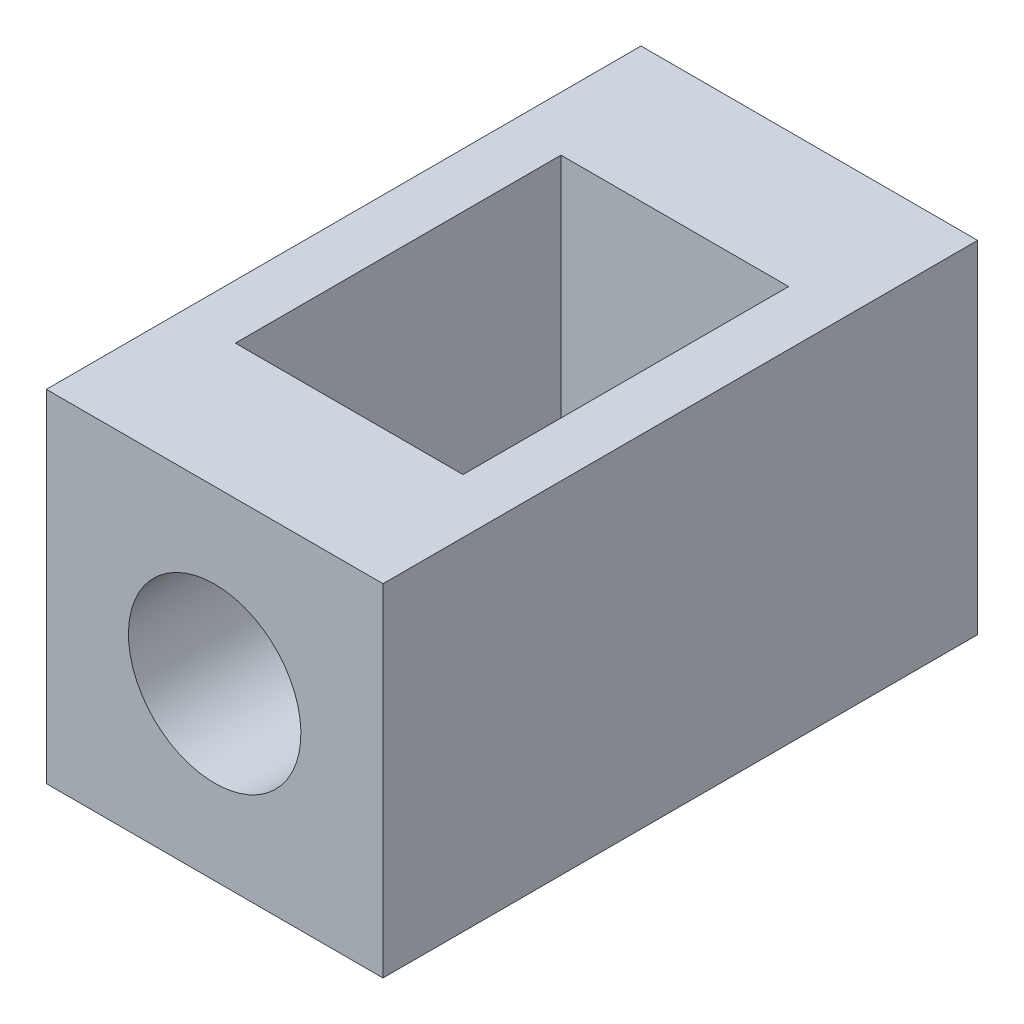
ISO-10303-21;
HEADER;
FILE_DESCRIPTION(('STEP AP214'),'2;1');
FILE_NAME('part.step','',(''),(''),'','','');
FILE_SCHEMA(('AUTOMOTIVE_DESIGN { 1 0 10303 214 1 1 1 1 }'));
ENDSEC;
DATA;
#1=APPLICATION_CONTEXT('core data for automotive mechanical design processes');
#2=APPLICATION_PROTOCOL_DEFINITION('international standard','automotive_design',2000,#1);
#3=PRODUCT_CONTEXT('',#1,'mechanical');
#4=PRODUCT('Part','Part','',(#3));
#5=PRODUCT_RELATED_PRODUCT_CATEGORY('part','',(#4));
#6=PRODUCT_DEFINITION_FORMATION('','',#4);
#7=PRODUCT_DEFINITION_CONTEXT('part definition',#1,'design');
#8=PRODUCT_DEFINITION('design','',#6,#7);
#9=PRODUCT_DEFINITION_SHAPE('','',#8);
#10=(LENGTH_UNIT() NAMED_UNIT(*) SI_UNIT(.MILLI.,.METRE.));
#11=(NAMED_UNIT(*) PLANE_ANGLE_UNIT() SI_UNIT($,.RADIAN.));
#12=(NAMED_UNIT(*) SI_UNIT($,.STERADIAN.) SOLID_ANGLE_UNIT());
#13=UNCERTAINTY_MEASURE_WITH_UNIT(LENGTH_MEASURE(1.E-05),#10,'distance_accuracy_value','');
#14=(GEOMETRIC_REPRESENTATION_CONTEXT(3) GLOBAL_UNCERTAINTY_ASSIGNED_CONTEXT((#13)) GLOBAL_UNIT_ASSIGNED_CONTEXT((#10,
#11,#12)) REPRESENTATION_CONTEXT('',''));
#15=CARTESIAN_POINT('',(0.,0.,0.));
#16=DIRECTION('',(0.,0.,1.));
#17=DIRECTION('',(1.,0.,0.));
#18=AXIS2_PLACEMENT_3D('',#15,#16,#17);
#19=CARTESIAN_POINT('',(-22.8478019032069,-23.3190294111925,14.495));
#20=DIRECTION('',(0.,0.,1.));
#21=DIRECTION('',(3.01991605000675E-07,0.999999999999954,0.));
#22=AXIS2_PLACEMENT_3D('',#19,#20,#21);
#23=CYLINDRICAL_SURFACE('',#22,1.25);
#24=CARTESIAN_POINT('',(-22.8478019032069,-23.3190294111928,12.545));
#25=DIRECTION('',(0.,0.,1.));
#26=DIRECTION('',(3.01991605000675E-07,0.999999999999954,0.));
#27=AXIS2_PLACEMENT_3D('',#24,#25,#26);
#28=CIRCLE('',#27,1.25);
#29=CARTESIAN_POINT('',(-22.8478015257173,-22.0690294111928,12.545));
#30=VERTEX_POINT('',#29);
#31=EDGE_CURVE('E20',#30,#30,#28,.T.);
#32=ORIENTED_EDGE('',*,*,#31,.F.);
#33=EDGE_LOOP('',(#32));
#34=FACE_BOUND('',#33,.T.);
#35=CARTESIAN_POINT('',(-22.8478019032069,-23.3190294111925,14.495));
#36=DIRECTION('',(0.,0.,1.));
#37=DIRECTION('',(3.01991605000675E-07,0.999999999999954,0.));
#38=AXIS2_PLACEMENT_3D('',#35,#36,#37);
#39=CIRCLE('',#38,1.25);
#40=CARTESIAN_POINT('',(-22.8478015257173,-22.0690294111926,14.495));
#41=VERTEX_POINT('',#40);
#42=EDGE_CURVE('E11',#41,#41,#39,.T.);
#43=ORIENTED_EDGE('',*,*,#42,.T.);
#44=EDGE_LOOP('',(#43));
#45=FACE_BOUND('',#44,.T.);
#46=ADVANCED_FACE('F17',(#34,#45),#23,.F.);
#47=CARTESIAN_POINT('',(-20.4078026506358,-25.7940301480523,14.495));
#48=DIRECTION('',(-0.999999999999954,3.01991605000676E-07,0.));
#49=DIRECTION('',(3.01991605000675E-07,0.999999999999954,0.));
#50=AXIS2_PLACEMENT_3D('',#47,#48,#49);
#51=PLANE('',#50);
#52=DIRECTION('',(0.,0.,1.));
#53=VECTOR('',#52,1.);
#54=CARTESIAN_POINT('',(-20.4078011557778,-20.8440301480525,14.495));
#55=LINE('',#54,#53);
#56=CARTESIAN_POINT('',(-20.4078011557778,-20.8440301480528,5.875));
#57=VERTEX_POINT('',#56);
#58=CARTESIAN_POINT('',(-20.4078011557778,-20.8440301480525,14.495));
#59=VERTEX_POINT('',#58);
#60=EDGE_CURVE('E171',#57,#59,#55,.T.);
#61=ORIENTED_EDGE('',*,*,#60,.T.);
#62=DIRECTION('',(3.01991605000675E-07,0.999999999999954,0.));
#63=VECTOR('',#62,1.);
#64=CARTESIAN_POINT('',(-20.4078026506358,-25.7940301480523,14.495));
#65=LINE('',#64,#63);
#66=CARTESIAN_POINT('',(-20.4078026506358,-25.7940301480523,14.495));
#67=VERTEX_POINT('',#66);
#68=EDGE_CURVE('E27',#67,#59,#65,.T.);
#69=ORIENTED_EDGE('',*,*,#68,.F.);
#70=DIRECTION('',(0.,0.,1.));
#71=VECTOR('',#70,1.);
#72=CARTESIAN_POINT('',(-20.4078026506358,-25.7940301480523,14.495));
#73=LINE('',#72,#71);
#74=CARTESIAN_POINT('',(-20.4078026506358,-25.7940301480522,5.875));
#75=VERTEX_POINT('',#74);
#76=EDGE_CURVE('E224',#75,#67,#73,.T.);
#77=ORIENTED_EDGE('',*,*,#76,.F.);
#78=DIRECTION('',(3.01991605000675E-07,0.999999999999954,0.));
#79=VECTOR('',#78,1.);
#80=CARTESIAN_POINT('',(-20.4078026506358,-25.7940301480522,5.875));
#81=LINE('',#80,#79);
#82=EDGE_CURVE('E73',#75,#57,#81,.T.);
#83=ORIENTED_EDGE('',*,*,#82,.T.);
#84=EDGE_LOOP('',(#61,#69,#77,#83));
#85=FACE_BOUND('',#84,.T.);
#86=ADVANCED_FACE('F282',(#85),#51,.F.);
#87=CARTESIAN_POINT('',(-25.2878026506358,-25.7940286743332,14.495));
#88=DIRECTION('',(0.,0.,-1.));
#89=DIRECTION('',(0.999999999999954,-3.01991605000676E-07,0.));
#90=AXIS2_PLACEMENT_3D('',#87,#88,#89);
#91=PLANE('',#90);
#92=ORIENTED_EDGE('',*,*,#42,.F.);
#93=EDGE_LOOP('',(#92));
#94=FACE_BOUND('',#93,.T.);
#95=DIRECTION('',(-0.999999999999954,3.01991605000676E-07,0.));
#96=VECTOR('',#95,1.);
#97=CARTESIAN_POINT('',(-25.2878011557778,-20.8440286743335,14.495));
#98=LINE('',#97,#96);
#99=CARTESIAN_POINT('',(-25.2878011557778,-20.8440286743335,14.495));
#100=VERTEX_POINT('',#99);
#101=EDGE_CURVE('E208',#59,#100,#98,.T.);
#102=ORIENTED_EDGE('',*,*,#101,.T.);
#103=DIRECTION('',(3.01991605000675E-07,0.999999999999954,0.));
#104=VECTOR('',#103,1.);
#105=CARTESIAN_POINT('',(-25.2878026506358,-25.7940286743332,14.495));
#106=LINE('',#105,#104);
#107=CARTESIAN_POINT('',(-25.2878026506358,-25.7940286743332,14.495));
#108=VERTEX_POINT('',#107);
#109=EDGE_CURVE('E213',#108,#100,#106,.T.);
#110=ORIENTED_EDGE('',*,*,#109,.F.);
#111=DIRECTION('',(-0.999999999999954,3.01991605000676E-07,0.));
#112=VECTOR('',#111,1.);
#113=CARTESIAN_POINT('',(-25.2878026506358,-25.7940286743332,14.495));
#114=LINE('',#113,#112);
#115=EDGE_CURVE('E219',#67,#108,#114,.T.);
#116=ORIENTED_EDGE('',*,*,#115,.F.);
#117=ORIENTED_EDGE('',*,*,#68,.T.);
#118=EDGE_LOOP('',(#102,#110,#116,#117));
#119=FACE_BOUND('',#118,.T.);
#120=ADVANCED_FACE('F285',(#94,#119),#91,.F.);
#121=CARTESIAN_POINT('',(-25.2878026506358,-25.7940286743332,14.495));
#122=DIRECTION('',(0.999999999999954,-3.01991605000676E-07,0.));
#123=DIRECTION('',(-3.01991605000675E-07,-0.999999999999954,0.));
#124=AXIS2_PLACEMENT_3D('',#121,#122,#123);
#125=PLANE('',#124);
#126=DIRECTION('',(0.,0.,-1.));
#127=VECTOR('',#126,1.);
#128=CARTESIAN_POINT('',(-25.2878011557778,-20.8440286743335,14.495));
#129=LINE('',#128,#127);
#130=CARTESIAN_POINT('',(-25.2878011557778,-20.8440286743338,5.875));
#131=VERTEX_POINT('',#130);
#132=EDGE_CURVE('E196',#100,#131,#129,.T.);
#133=ORIENTED_EDGE('',*,*,#132,.T.);
#134=DIRECTION('',(3.01991605000675E-07,0.999999999999954,0.));
#135=VECTOR('',#134,1.);
#136=CARTESIAN_POINT('',(-25.2878026506358,-25.7940286743332,5.875));
#137=LINE('',#136,#135);
#138=CARTESIAN_POINT('',(-25.2878026506358,-25.7940286743332,5.875));
#139=VERTEX_POINT('',#138);
#140=EDGE_CURVE('E39',#139,#131,#137,.T.);
#141=ORIENTED_EDGE('',*,*,#140,.F.);
#142=DIRECTION('',(0.,0.,-1.));
#143=VECTOR('',#142,1.);
#144=CARTESIAN_POINT('',(-25.2878026506358,-25.7940286743332,14.495));
#145=LINE('',#144,#143);
#146=EDGE_CURVE('E203',#108,#139,#145,.T.);
#147=ORIENTED_EDGE('',*,*,#146,.F.);
#148=ORIENTED_EDGE('',*,*,#109,.T.);
#149=EDGE_LOOP('',(#133,#141,#147,#148));
#150=FACE_BOUND('',#149,.T.);
#151=ADVANCED_FACE('F287',(#150),#125,.F.);
#152=CARTESIAN_POINT('',(-25.2878026506358,-25.7940286743332,5.875));
#153=DIRECTION('',(0.,0.,1.));
#154=DIRECTION('',(-0.999999999999954,3.01991605000676E-07,0.));
#155=AXIS2_PLACEMENT_3D('',#152,#153,#154);
#156=PLANE('',#155);
#157=DIRECTION('',(0.999999999999954,-3.01991605000676E-07,0.));
#158=VECTOR('',#157,1.);
#159=CARTESIAN_POINT('',(-25.2878011557778,-20.8440286743338,5.875));
#160=LINE('',#159,#158);
#161=EDGE_CURVE('E193',#131,#57,#160,.T.);
#162=ORIENTED_EDGE('',*,*,#161,.T.);
#163=ORIENTED_EDGE('',*,*,#82,.F.);
#164=DIRECTION('',(0.999999999999954,-3.01991605000676E-07,0.));
#165=VECTOR('',#164,1.);
#166=CARTESIAN_POINT('',(-25.2878026506358,-25.7940286743332,5.875));
#167=LINE('',#166,#165);
#168=EDGE_CURVE('E199',#139,#75,#167,.T.);
#169=ORIENTED_EDGE('',*,*,#168,.F.);
#170=ORIENTED_EDGE('',*,*,#140,.T.);
#171=EDGE_LOOP('',(#162,#163,#169,#170));
#172=FACE_BOUND('',#171,.T.);
#173=ADVANCED_FACE('F303',(#172),#156,.F.);
#174=CARTESIAN_POINT('',(-22.8478026506358,-25.7940294111928,10.185));
#175=DIRECTION('',(-3.01991605000675E-07,-0.999999999999954,0.));
#176=DIRECTION('',(-0.999999999999954,3.01991605000676E-07,0.));
#177=AXIS2_PLACEMENT_3D('',#174,#175,#176);
#178=PLANE('',#177);
#179=DIRECTION('',(0.,0.,1.));
#180=VECTOR('',#179,1.);
#181=CARTESIAN_POINT('',(-21.1978026506358,-25.7940299094789,10.185));
#182=LINE('',#181,#180);
#183=CARTESIAN_POINT('',(-21.1978026506358,-25.7940299094789,7.825));
#184=VERTEX_POINT('',#183);
#185=CARTESIAN_POINT('',(-21.1978026506358,-25.7940299094789,12.545));
#186=VERTEX_POINT('',#185);
#187=EDGE_CURVE('E166',#184,#186,#182,.T.);
#188=ORIENTED_EDGE('',*,*,#187,.F.);
#189=DIRECTION('',(0.999999999999954,-3.01991605000676E-07,0.));
#190=VECTOR('',#189,1.);
#191=CARTESIAN_POINT('',(-22.8478026506358,-25.7940294111928,7.825));
#192=LINE('',#191,#190);
#193=CARTESIAN_POINT('',(-24.4978026506358,-25.7940289129066,7.825));
#194=VERTEX_POINT('',#193);
#195=EDGE_CURVE('E127',#194,#184,#192,.T.);
#196=ORIENTED_EDGE('',*,*,#195,.F.);
#197=DIRECTION('',(0.,0.,-1.));
#198=VECTOR('',#197,1.);
#199=CARTESIAN_POINT('',(-24.4978026506358,-25.7940289129066,10.185));
#200=LINE('',#199,#198);
#201=CARTESIAN_POINT('',(-24.4978026506358,-25.7940289129066,12.545));
#202=VERTEX_POINT('',#201);
#203=EDGE_CURVE('E151',#202,#194,#200,.T.);
#204=ORIENTED_EDGE('',*,*,#203,.F.);
#205=DIRECTION('',(-0.999999999999954,3.01991605000676E-07,0.));
#206=VECTOR('',#205,1.);
#207=CARTESIAN_POINT('',(-22.8478026506358,-25.7940294111927,12.545));
#208=LINE('',#207,#206);
#209=EDGE_CURVE('E140',#186,#202,#208,.T.);
#210=ORIENTED_EDGE('',*,*,#209,.F.);
#211=EDGE_LOOP('',(#188,#196,#204,#210));
#212=FACE_BOUND('',#211,.T.);
#213=ORIENTED_EDGE('',*,*,#76,.T.);
#214=ORIENTED_EDGE('',*,*,#115,.T.);
#215=ORIENTED_EDGE('',*,*,#146,.T.);
#216=ORIENTED_EDGE('',*,*,#168,.T.);
#217=EDGE_LOOP('',(#213,#214,#215,#216));
#218=FACE_BOUND('',#217,.T.);
#219=ADVANCED_FACE('F293',(#212,#218),#178,.T.);
#220=CARTESIAN_POINT('',(-22.8478011557778,-20.8440294111927,10.185));
#221=DIRECTION('',(-3.01991605000675E-07,-0.999999999999954,0.));
#222=DIRECTION('',(-0.999999999999954,3.01991605000676E-07,0.));
#223=AXIS2_PLACEMENT_3D('',#220,#221,#222);
#224=PLANE('',#223);
#225=DIRECTION('',(0.999999999999954,-3.01991605000676E-07,0.));
#226=VECTOR('',#225,1.);
#227=CARTESIAN_POINT('',(-24.4978011557778,-20.8440289129065,7.825));
#228=LINE('',#227,#226);
#229=CARTESIAN_POINT('',(-24.4978011557778,-20.8440289129065,7.825));
#230=VERTEX_POINT('',#229);
#231=CARTESIAN_POINT('',(-21.1978011557778,-20.8440299094796,7.825));
#232=VERTEX_POINT('',#231);
#233=EDGE_CURVE('E161',#230,#232,#228,.T.);
#234=ORIENTED_EDGE('',*,*,#233,.T.);
#235=DIRECTION('',(0.,0.,1.));
#236=VECTOR('',#235,1.);
#237=CARTESIAN_POINT('',(-21.1978011557778,-20.8440299094788,12.545));
#238=LINE('',#237,#236);
#239=CARTESIAN_POINT('',(-21.1978011557778,-20.8440299094788,12.545));
#240=VERTEX_POINT('',#239);
#241=EDGE_CURVE('E84',#232,#240,#238,.T.);
#242=ORIENTED_EDGE('',*,*,#241,.T.);
#243=DIRECTION('',(-0.999999999999954,3.01991605000676E-07,0.));
#244=VECTOR('',#243,1.);
#245=CARTESIAN_POINT('',(-24.4978011557778,-20.8440289129067,12.545));
#246=LINE('',#245,#244);
#247=CARTESIAN_POINT('',(-24.4978011557778,-20.8440289129067,12.545));
#248=VERTEX_POINT('',#247);
#249=EDGE_CURVE('E130',#240,#248,#246,.T.);
#250=ORIENTED_EDGE('',*,*,#249,.T.);
#251=DIRECTION('',(0.,0.,-1.));
#252=VECTOR('',#251,1.);
#253=CARTESIAN_POINT('',(-24.4978011557778,-20.8440289129067,12.545));
#254=LINE('',#253,#252);
#255=EDGE_CURVE('E116',#248,#230,#254,.T.);
#256=ORIENTED_EDGE('',*,*,#255,.T.);
#257=EDGE_LOOP('',(#234,#242,#250,#256));
#258=FACE_BOUND('',#257,.T.);
#259=ORIENTED_EDGE('',*,*,#60,.F.);
#260=ORIENTED_EDGE('',*,*,#161,.F.);
#261=ORIENTED_EDGE('',*,*,#132,.F.);
#262=ORIENTED_EDGE('',*,*,#101,.F.);
#263=EDGE_LOOP('',(#259,#260,#261,#262));
#264=FACE_BOUND('',#263,.T.);
#265=ADVANCED_FACE('F131',(#258,#264),#224,.F.);
#266=CARTESIAN_POINT('',(-21.1978011557778,-20.8440299094788,12.545));
#267=DIRECTION('',(0.999999999999954,-3.01991605000676E-07,0.));
#268=DIRECTION('',(-3.01991605000675E-07,-0.999999999999954,0.));
#269=AXIS2_PLACEMENT_3D('',#266,#267,#268);
#270=PLANE('',#269);
#271=ORIENTED_EDGE('',*,*,#187,.T.);
#272=DIRECTION('',(-3.01991605000675E-07,-0.999999999999954,0.));
#273=VECTOR('',#272,1.);
#274=CARTESIAN_POINT('',(-21.1978011557778,-20.8440299094788,12.545));
#275=LINE('',#274,#273);
#276=EDGE_CURVE('E136',#240,#186,#275,.T.);
#277=ORIENTED_EDGE('',*,*,#276,.F.);
#278=ORIENTED_EDGE('',*,*,#241,.F.);
#279=DIRECTION('',(-3.01991605000675E-07,-0.999999999999954,0.));
#280=VECTOR('',#279,1.);
#281=CARTESIAN_POINT('',(-21.1978011557778,-20.8440299094796,7.825));
#282=LINE('',#281,#280);
#283=EDGE_CURVE('E158',#232,#184,#282,.T.);
#284=ORIENTED_EDGE('',*,*,#283,.T.);
#285=EDGE_LOOP('',(#271,#277,#278,#284));
#286=FACE_BOUND('',#285,.T.);
#287=ADVANCED_FACE('F312',(#286),#270,.F.);
#288=CARTESIAN_POINT('',(-24.4978011557778,-20.8440289129065,7.825));
#289=DIRECTION('',(0.,0.,-1.));
#290=DIRECTION('',(-3.01991605000675E-07,-0.999999999999954,0.));
#291=AXIS2_PLACEMENT_3D('',#288,#289,#290);
#292=PLANE('',#291);
#293=ORIENTED_EDGE('',*,*,#195,.T.);
#294=ORIENTED_EDGE('',*,*,#283,.F.);
#295=ORIENTED_EDGE('',*,*,#233,.F.);
#296=DIRECTION('',(-3.01991605000675E-07,-0.999999999999954,0.));
#297=VECTOR('',#296,1.);
#298=CARTESIAN_POINT('',(-24.4978011557778,-20.8440289129065,7.825));
#299=LINE('',#298,#297);
#300=EDGE_CURVE('E124',#230,#194,#299,.T.);
#301=ORIENTED_EDGE('',*,*,#300,.T.);
#302=EDGE_LOOP('',(#293,#294,#295,#301));
#303=FACE_BOUND('',#302,.T.);
#304=ADVANCED_FACE('F315',(#303),#292,.F.);
#305=CARTESIAN_POINT('',(-24.4978011557778,-20.8440289129067,12.545));
#306=DIRECTION('',(-0.999999999999954,3.01991605000676E-07,0.));
#307=DIRECTION('',(3.01991605000675E-07,0.999999999999954,0.));
#308=AXIS2_PLACEMENT_3D('',#305,#306,#307);
#309=PLANE('',#308);
#310=ORIENTED_EDGE('',*,*,#203,.T.);
#311=ORIENTED_EDGE('',*,*,#300,.F.);
#312=ORIENTED_EDGE('',*,*,#255,.F.);
#313=DIRECTION('',(-3.01991605000675E-07,-0.999999999999954,0.));
#314=VECTOR('',#313,1.);
#315=CARTESIAN_POINT('',(-24.4978011557778,-20.8440289129067,12.545));
#316=LINE('',#315,#314);
#317=EDGE_CURVE('E121',#248,#202,#316,.T.);
#318=ORIENTED_EDGE('',*,*,#317,.T.);
#319=EDGE_LOOP('',(#310,#311,#312,#318));
#320=FACE_BOUND('',#319,.T.);
#321=ADVANCED_FACE('F119',(#320),#309,.F.);
#322=CARTESIAN_POINT('',(-24.4978011557778,-20.8440289129067,12.545));
#323=DIRECTION('',(0.,0.,1.));
#324=DIRECTION('',(3.01991605000675E-07,0.999999999999954,0.));
#325=AXIS2_PLACEMENT_3D('',#322,#323,#324);
#326=PLANE('',#325);
#327=ORIENTED_EDGE('',*,*,#31,.T.);
#328=EDGE_LOOP('',(#327));
#329=FACE_BOUND('',#328,.T.);
#330=ORIENTED_EDGE('',*,*,#209,.T.);
#331=ORIENTED_EDGE('',*,*,#317,.F.);
#332=ORIENTED_EDGE('',*,*,#249,.F.);
#333=ORIENTED_EDGE('',*,*,#276,.T.);
#334=EDGE_LOOP('',(#330,#331,#332,#333));
#335=FACE_BOUND('',#334,.T.);
#336=ADVANCED_FACE('F138',(#329,#335),#326,.F.);
#337=CLOSED_SHELL('',(#46,#86,#120,#151,#173,#219,#265,#287,#304,#321,#336));
#338=MANIFOLD_SOLID_BREP('B1',#337);
#339=ADVANCED_BREP_SHAPE_REPRESENTATION('',(#18,#338),#14);
#340=SHAPE_DEFINITION_REPRESENTATION(#9,#339);
ENDSEC;
END-ISO-10303-21;
